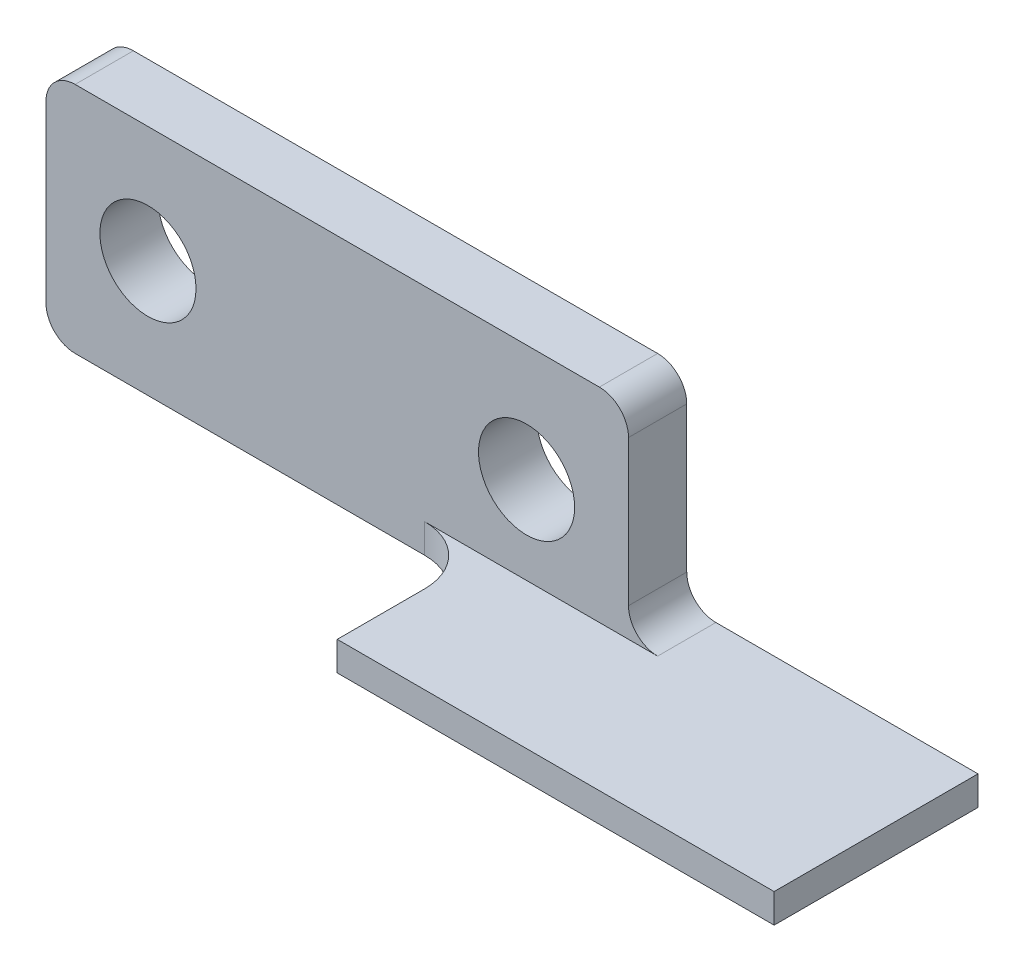
ISO-10303-21;
HEADER;
FILE_DESCRIPTION(('STEP AP214'),'2;1');
FILE_NAME('part.step','',(''),(''),'','','');
FILE_SCHEMA(('AUTOMOTIVE_DESIGN { 1 0 10303 214 1 1 1 1 }'));
ENDSEC;
DATA;
#1=APPLICATION_CONTEXT('core data for automotive mechanical design processes');
#2=APPLICATION_PROTOCOL_DEFINITION('international standard','automotive_design',2000,#1);
#3=PRODUCT_CONTEXT('',#1,'mechanical');
#4=PRODUCT('Part','Part','',(#3));
#5=PRODUCT_RELATED_PRODUCT_CATEGORY('part','',(#4));
#6=PRODUCT_DEFINITION_FORMATION('','',#4);
#7=PRODUCT_DEFINITION_CONTEXT('part definition',#1,'design');
#8=PRODUCT_DEFINITION('design','',#6,#7);
#9=PRODUCT_DEFINITION_SHAPE('','',#8);
#10=(LENGTH_UNIT() NAMED_UNIT(*) SI_UNIT(.MILLI.,.METRE.));
#11=(NAMED_UNIT(*) PLANE_ANGLE_UNIT() SI_UNIT($,.RADIAN.));
#12=(NAMED_UNIT(*) SI_UNIT($,.STERADIAN.) SOLID_ANGLE_UNIT());
#13=UNCERTAINTY_MEASURE_WITH_UNIT(LENGTH_MEASURE(1.E-05),#10,'distance_accuracy_value','');
#14=(GEOMETRIC_REPRESENTATION_CONTEXT(3) GLOBAL_UNCERTAINTY_ASSIGNED_CONTEXT((#13)) GLOBAL_UNIT_ASSIGNED_CONTEXT((#10,
#11,#12)) REPRESENTATION_CONTEXT('',''));
#15=CARTESIAN_POINT('',(0.,0.,0.));
#16=DIRECTION('',(0.,0.,1.));
#17=DIRECTION('',(1.,0.,0.));
#18=AXIS2_PLACEMENT_3D('',#15,#16,#17);
#19=CARTESIAN_POINT('',(0.,0.,2.));
#20=DIRECTION('',(1.,0.,0.));
#21=DIRECTION('',(0.,0.,-1.));
#22=AXIS2_PLACEMENT_3D('',#19,#20,#21);
#23=PLANE('',#22);
#24=DIRECTION('',(0.,-1.,0.));
#25=VECTOR('',#24,1.);
#26=CARTESIAN_POINT('',(0.,0.,2.));
#27=LINE('',#26,#25);
#28=CARTESIAN_POINT('',(0.,7.,2.));
#29=VERTEX_POINT('',#28);
#30=CARTESIAN_POINT('',(0.,1.,2.));
#31=VERTEX_POINT('',#30);
#32=EDGE_CURVE('E167',#29,#31,#27,.T.);
#33=ORIENTED_EDGE('',*,*,#32,.F.);
#34=DIRECTION('',(0.,0.,-1.));
#35=VECTOR('',#34,1.);
#36=CARTESIAN_POINT('',(0.,7.,2.));
#37=LINE('',#36,#35);
#38=CARTESIAN_POINT('',(0.,7.,0.));
#39=VERTEX_POINT('',#38);
#40=EDGE_CURVE('E216',#29,#39,#37,.T.);
#41=ORIENTED_EDGE('',*,*,#40,.T.);
#42=DIRECTION('',(0.,-1.,0.));
#43=VECTOR('',#42,1.);
#44=CARTESIAN_POINT('',(0.,0.,0.));
#45=LINE('',#44,#43);
#46=CARTESIAN_POINT('',(0.,1.,0.));
#47=VERTEX_POINT('',#46);
#48=EDGE_CURVE('E166',#39,#47,#45,.T.);
#49=ORIENTED_EDGE('',*,*,#48,.T.);
#50=DIRECTION('',(0.,0.,-1.));
#51=VECTOR('',#50,1.);
#52=CARTESIAN_POINT('',(0.,1.,2.));
#53=LINE('',#52,#51);
#54=EDGE_CURVE('E214',#47,#31,#53,.F.);
#55=ORIENTED_EDGE('',*,*,#54,.T.);
#56=EDGE_LOOP('',(#33,#41,#49,#55));
#57=FACE_BOUND('',#56,.T.);
#58=ADVANCED_FACE('F30',(#57),#23,.F.);
#59=CARTESIAN_POINT('',(0.,0.,2.));
#60=DIRECTION('',(0.,1.,0.));
#61=DIRECTION('',(0.,0.,1.));
#62=AXIS2_PLACEMENT_3D('',#59,#60,#61);
#63=PLANE('',#62);
#64=DIRECTION('',(1.,0.,0.));
#65=VECTOR('',#64,1.);
#66=CARTESIAN_POINT('',(0.,0.,2.));
#67=LINE('',#66,#65);
#68=CARTESIAN_POINT('',(1.,0.,2.));
#69=VERTEX_POINT('',#68);
#70=CARTESIAN_POINT('',(13.,0.,2.));
#71=VERTEX_POINT('',#70);
#72=EDGE_CURVE('E170',#69,#71,#67,.T.);
#73=ORIENTED_EDGE('',*,*,#72,.F.);
#74=DIRECTION('',(0.,0.,-1.));
#75=VECTOR('',#74,1.);
#76=CARTESIAN_POINT('',(1.,0.,2.));
#77=LINE('',#76,#75);
#78=CARTESIAN_POINT('',(1.,0.,0.));
#79=VERTEX_POINT('',#78);
#80=EDGE_CURVE('E219',#69,#79,#77,.T.);
#81=ORIENTED_EDGE('',*,*,#80,.T.);
#82=DIRECTION('',(1.,0.,0.));
#83=VECTOR('',#82,1.);
#84=CARTESIAN_POINT('',(0.,0.,0.));
#85=LINE('',#84,#83);
#86=CARTESIAN_POINT('',(30.,0.,0.));
#87=VERTEX_POINT('',#86);
#88=EDGE_CURVE('E183',#79,#87,#85,.T.);
#89=ORIENTED_EDGE('',*,*,#88,.T.);
#90=DIRECTION('',(0.,0.,1.));
#91=VECTOR('',#90,1.);
#92=CARTESIAN_POINT('',(30.,0.,0.));
#93=LINE('',#92,#91);
#94=CARTESIAN_POINT('',(30.,0.,7.));
#95=VERTEX_POINT('',#94);
#96=EDGE_CURVE('E128',#87,#95,#93,.T.);
#97=ORIENTED_EDGE('',*,*,#96,.T.);
#98=DIRECTION('',(1.,0.,0.));
#99=VECTOR('',#98,1.);
#100=CARTESIAN_POINT('',(15.,0.,7.));
#101=LINE('',#100,#99);
#102=CARTESIAN_POINT('',(15.,0.,7.));
#103=VERTEX_POINT('',#102);
#104=EDGE_CURVE('E132',#103,#95,#101,.T.);
#105=ORIENTED_EDGE('',*,*,#104,.F.);
#106=DIRECTION('',(0.,0.,1.));
#107=VECTOR('',#106,1.);
#108=CARTESIAN_POINT('',(15.,0.,0.));
#109=LINE('',#108,#107);
#110=CARTESIAN_POINT('',(15.,0.,4.));
#111=VERTEX_POINT('',#110);
#112=EDGE_CURVE('E121',#111,#103,#109,.T.);
#113=ORIENTED_EDGE('',*,*,#112,.F.);
#114=CARTESIAN_POINT('',(13.,0.,4.));
#115=DIRECTION('',(0.,1.,0.));
#116=DIRECTION('',(0.,0.,1.));
#117=AXIS2_PLACEMENT_3D('',#114,#115,#116);
#118=CIRCLE('',#117,2.);
#119=EDGE_CURVE('E11',#111,#71,#118,.T.);
#120=ORIENTED_EDGE('',*,*,#119,.T.);
#121=EDGE_LOOP('',(#73,#81,#89,#97,#105,#113,#120));
#122=FACE_BOUND('',#121,.T.);
#123=ADVANCED_FACE('F134',(#122),#63,.F.);
#124=CARTESIAN_POINT('',(20.,0.,2.));
#125=DIRECTION('',(-1.,0.,0.));
#126=DIRECTION('',(0.,0.,1.));
#127=AXIS2_PLACEMENT_3D('',#124,#125,#126);
#128=PLANE('',#127);
#129=DIRECTION('',(0.,1.,0.));
#130=VECTOR('',#129,1.);
#131=CARTESIAN_POINT('',(20.,0.,2.));
#132=LINE('',#131,#130);
#133=CARTESIAN_POINT('',(20.,2.,2.));
#134=VERTEX_POINT('',#133);
#135=CARTESIAN_POINT('',(20.,7.,2.));
#136=VERTEX_POINT('',#135);
#137=EDGE_CURVE('E174',#134,#136,#132,.T.);
#138=ORIENTED_EDGE('',*,*,#137,.F.);
#139=DIRECTION('',(0.,0.,-1.));
#140=VECTOR('',#139,1.);
#141=CARTESIAN_POINT('',(20.,2.,2.));
#142=LINE('',#141,#140);
#143=CARTESIAN_POINT('',(20.,2.,0.));
#144=VERTEX_POINT('',#143);
#145=EDGE_CURVE('E191',#134,#144,#142,.T.);
#146=ORIENTED_EDGE('',*,*,#145,.T.);
#147=DIRECTION('',(0.,1.,0.));
#148=VECTOR('',#147,1.);
#149=CARTESIAN_POINT('',(20.,0.,0.));
#150=LINE('',#149,#148);
#151=CARTESIAN_POINT('',(20.,7.,0.));
#152=VERTEX_POINT('',#151);
#153=EDGE_CURVE('E185',#144,#152,#150,.T.);
#154=ORIENTED_EDGE('',*,*,#153,.T.);
#155=DIRECTION('',(0.,0.,-1.));
#156=VECTOR('',#155,1.);
#157=CARTESIAN_POINT('',(20.,7.,2.));
#158=LINE('',#157,#156);
#159=EDGE_CURVE('E180',#152,#136,#158,.F.);
#160=ORIENTED_EDGE('',*,*,#159,.T.);
#161=EDGE_LOOP('',(#138,#146,#154,#160));
#162=FACE_BOUND('',#161,.T.);
#163=ADVANCED_FACE('F262',(#162),#128,.F.);
#164=CARTESIAN_POINT('',(0.,8.,2.));
#165=DIRECTION('',(0.,-1.,0.));
#166=DIRECTION('',(0.,0.,-1.));
#167=AXIS2_PLACEMENT_3D('',#164,#165,#166);
#168=PLANE('',#167);
#169=DIRECTION('',(-1.,0.,0.));
#170=VECTOR('',#169,1.);
#171=CARTESIAN_POINT('',(0.,8.,2.));
#172=LINE('',#171,#170);
#173=CARTESIAN_POINT('',(19.,8.,2.));
#174=VERTEX_POINT('',#173);
#175=CARTESIAN_POINT('',(1.,8.,2.));
#176=VERTEX_POINT('',#175);
#177=EDGE_CURVE('E177',#174,#176,#172,.T.);
#178=ORIENTED_EDGE('',*,*,#177,.F.);
#179=DIRECTION('',(0.,0.,-1.));
#180=VECTOR('',#179,1.);
#181=CARTESIAN_POINT('',(19.,8.,2.));
#182=LINE('',#181,#180);
#183=CARTESIAN_POINT('',(19.,8.,0.));
#184=VERTEX_POINT('',#183);
#185=EDGE_CURVE('E199',#174,#184,#182,.T.);
#186=ORIENTED_EDGE('',*,*,#185,.T.);
#187=DIRECTION('',(-1.,0.,0.));
#188=VECTOR('',#187,1.);
#189=CARTESIAN_POINT('',(0.,8.,0.));
#190=LINE('',#189,#188);
#191=CARTESIAN_POINT('',(1.,8.,0.));
#192=VERTEX_POINT('',#191);
#193=EDGE_CURVE('E171',#184,#192,#190,.T.);
#194=ORIENTED_EDGE('',*,*,#193,.T.);
#195=DIRECTION('',(0.,0.,-1.));
#196=VECTOR('',#195,1.);
#197=CARTESIAN_POINT('',(1.,8.,2.));
#198=LINE('',#197,#196);
#199=EDGE_CURVE('E197',#192,#176,#198,.F.);
#200=ORIENTED_EDGE('',*,*,#199,.T.);
#201=EDGE_LOOP('',(#178,#186,#194,#200));
#202=FACE_BOUND('',#201,.T.);
#203=ADVANCED_FACE('F253',(#202),#168,.F.);
#204=CARTESIAN_POINT('',(0.,8.,2.));
#205=DIRECTION('',(0.,0.,-1.));
#206=DIRECTION('',(-1.,0.,0.));
#207=AXIS2_PLACEMENT_3D('',#204,#205,#206);
#208=PLANE('',#207);
#209=CARTESIAN_POINT('',(16.5,4.,2.));
#210=DIRECTION('',(0.,0.,1.));
#211=DIRECTION('',(1.,0.,0.));
#212=AXIS2_PLACEMENT_3D('',#209,#210,#211);
#213=CIRCLE('',#212,1.65);
#214=CARTESIAN_POINT('',(18.15,4.,2.));
#215=VERTEX_POINT('',#214);
#216=EDGE_CURVE('E421',#215,#215,#213,.T.);
#217=ORIENTED_EDGE('',*,*,#216,.F.);
#218=EDGE_LOOP('',(#217));
#219=FACE_BOUND('',#218,.T.);
#220=CARTESIAN_POINT('',(3.5,4.,2.));
#221=DIRECTION('',(0.,0.,1.));
#222=DIRECTION('',(1.,0.,0.));
#223=AXIS2_PLACEMENT_3D('',#220,#221,#222);
#224=CIRCLE('',#223,1.65);
#225=CARTESIAN_POINT('',(5.15,4.,2.));
#226=VERTEX_POINT('',#225);
#227=EDGE_CURVE('E148',#226,#226,#224,.T.);
#228=ORIENTED_EDGE('',*,*,#227,.F.);
#229=EDGE_LOOP('',(#228));
#230=FACE_BOUND('',#229,.T.);
#231=ORIENTED_EDGE('',*,*,#72,.T.);
#232=DIRECTION('',(0.,1.,0.));
#233=VECTOR('',#232,1.);
#234=CARTESIAN_POINT('',(13.,8.,2.));
#235=LINE('',#234,#233);
#236=CARTESIAN_POINT('',(13.,1.,2.));
#237=VERTEX_POINT('',#236);
#238=EDGE_CURVE('E226',#71,#237,#235,.T.);
#239=ORIENTED_EDGE('',*,*,#238,.T.);
#240=DIRECTION('',(1.,0.,0.));
#241=VECTOR('',#240,1.);
#242=CARTESIAN_POINT('',(0.,1.,2.));
#243=LINE('',#242,#241);
#244=CARTESIAN_POINT('',(21.,1.,2.));
#245=VERTEX_POINT('',#244);
#246=EDGE_CURVE('E161',#237,#245,#243,.T.);
#247=ORIENTED_EDGE('',*,*,#246,.T.);
#248=CARTESIAN_POINT('',(21.,2.,2.));
#249=DIRECTION('',(0.,0.,-1.));
#250=DIRECTION('',(-1.,0.,0.));
#251=AXIS2_PLACEMENT_3D('',#248,#249,#250);
#252=CIRCLE('',#251,1.);
#253=EDGE_CURVE('E224',#245,#134,#252,.T.);
#254=ORIENTED_EDGE('',*,*,#253,.T.);
#255=ORIENTED_EDGE('',*,*,#137,.T.);
#256=CARTESIAN_POINT('',(19.,7.,2.));
#257=DIRECTION('',(0.,0.,-1.));
#258=DIRECTION('',(-1.,0.,0.));
#259=AXIS2_PLACEMENT_3D('',#256,#257,#258);
#260=CIRCLE('',#259,1.);
#261=EDGE_CURVE('E212',#136,#174,#260,.F.);
#262=ORIENTED_EDGE('',*,*,#261,.T.);
#263=ORIENTED_EDGE('',*,*,#177,.T.);
#264=CARTESIAN_POINT('',(1.,7.,2.));
#265=DIRECTION('',(0.,0.,-1.));
#266=DIRECTION('',(-1.,0.,0.));
#267=AXIS2_PLACEMENT_3D('',#264,#265,#266);
#268=CIRCLE('',#267,1.);
#269=EDGE_CURVE('E210',#176,#29,#268,.F.);
#270=ORIENTED_EDGE('',*,*,#269,.T.);
#271=ORIENTED_EDGE('',*,*,#32,.T.);
#272=CARTESIAN_POINT('',(1.,1.,2.));
#273=DIRECTION('',(0.,0.,-1.));
#274=DIRECTION('',(-1.,0.,0.));
#275=AXIS2_PLACEMENT_3D('',#272,#273,#274);
#276=CIRCLE('',#275,1.);
#277=EDGE_CURVE('E208',#31,#69,#276,.F.);
#278=ORIENTED_EDGE('',*,*,#277,.T.);
#279=EDGE_LOOP('',(#231,#239,#247,#254,#255,#262,#263,#270,#271,#278));
#280=FACE_BOUND('',#279,.T.);
#281=ADVANCED_FACE('F231',(#219,#230,#280),#208,.F.);
#282=CARTESIAN_POINT('',(0.,8.,0.));
#283=DIRECTION('',(0.,0.,-1.));
#284=DIRECTION('',(-1.,0.,0.));
#285=AXIS2_PLACEMENT_3D('',#282,#283,#284);
#286=PLANE('',#285);
#287=CARTESIAN_POINT('',(16.5,4.,0.));
#288=DIRECTION('',(0.,0.,1.));
#289=DIRECTION('',(1.,0.,0.));
#290=AXIS2_PLACEMENT_3D('',#287,#288,#289);
#291=CIRCLE('',#290,1.65);
#292=CARTESIAN_POINT('',(18.15,4.,0.));
#293=VERTEX_POINT('',#292);
#294=EDGE_CURVE('E419',#293,#293,#291,.T.);
#295=ORIENTED_EDGE('',*,*,#294,.T.);
#296=EDGE_LOOP('',(#295));
#297=FACE_BOUND('',#296,.T.);
#298=CARTESIAN_POINT('',(3.5,4.,0.));
#299=DIRECTION('',(0.,0.,1.));
#300=DIRECTION('',(1.,0.,0.));
#301=AXIS2_PLACEMENT_3D('',#298,#299,#300);
#302=CIRCLE('',#301,1.65);
#303=CARTESIAN_POINT('',(5.15,4.,0.));
#304=VERTEX_POINT('',#303);
#305=EDGE_CURVE('E145',#304,#304,#302,.T.);
#306=ORIENTED_EDGE('',*,*,#305,.T.);
#307=EDGE_LOOP('',(#306));
#308=FACE_BOUND('',#307,.T.);
#309=ORIENTED_EDGE('',*,*,#193,.F.);
#310=CARTESIAN_POINT('',(19.,7.,0.));
#311=DIRECTION('',(0.,0.,-1.));
#312=DIRECTION('',(-1.,0.,0.));
#313=AXIS2_PLACEMENT_3D('',#310,#311,#312);
#314=CIRCLE('',#313,1.);
#315=EDGE_CURVE('E206',#184,#152,#314,.T.);
#316=ORIENTED_EDGE('',*,*,#315,.T.);
#317=ORIENTED_EDGE('',*,*,#153,.F.);
#318=CARTESIAN_POINT('',(21.,2.,0.));
#319=DIRECTION('',(0.,0.,-1.));
#320=DIRECTION('',(-1.,0.,0.));
#321=AXIS2_PLACEMENT_3D('',#318,#319,#320);
#322=CIRCLE('',#321,1.);
#323=CARTESIAN_POINT('',(21.,1.,0.));
#324=VERTEX_POINT('',#323);
#325=EDGE_CURVE('E222',#144,#324,#322,.F.);
#326=ORIENTED_EDGE('',*,*,#325,.T.);
#327=DIRECTION('',(-1.,0.,0.));
#328=VECTOR('',#327,1.);
#329=CARTESIAN_POINT('',(15.,1.,0.));
#330=LINE('',#329,#328);
#331=CARTESIAN_POINT('',(30.,1.,0.));
#332=VERTEX_POINT('',#331);
#333=EDGE_CURVE('E129',#332,#324,#330,.T.);
#334=ORIENTED_EDGE('',*,*,#333,.F.);
#335=DIRECTION('',(0.,1.,0.));
#336=VECTOR('',#335,1.);
#337=CARTESIAN_POINT('',(30.,0.,0.));
#338=LINE('',#337,#336);
#339=EDGE_CURVE('E154',#87,#332,#338,.T.);
#340=ORIENTED_EDGE('',*,*,#339,.F.);
#341=ORIENTED_EDGE('',*,*,#88,.F.);
#342=CARTESIAN_POINT('',(1.,1.,0.));
#343=DIRECTION('',(0.,0.,-1.));
#344=DIRECTION('',(-1.,0.,0.));
#345=AXIS2_PLACEMENT_3D('',#342,#343,#344);
#346=CIRCLE('',#345,1.);
#347=EDGE_CURVE('E202',#79,#47,#346,.T.);
#348=ORIENTED_EDGE('',*,*,#347,.T.);
#349=ORIENTED_EDGE('',*,*,#48,.F.);
#350=CARTESIAN_POINT('',(1.,7.,0.));
#351=DIRECTION('',(0.,0.,-1.));
#352=DIRECTION('',(-1.,0.,0.));
#353=AXIS2_PLACEMENT_3D('',#350,#351,#352);
#354=CIRCLE('',#353,1.);
#355=EDGE_CURVE('E204',#39,#192,#354,.T.);
#356=ORIENTED_EDGE('',*,*,#355,.T.);
#357=EDGE_LOOP('',(#309,#316,#317,#326,#334,#340,#341,#348,#349,#356));
#358=FACE_BOUND('',#357,.T.);
#359=ADVANCED_FACE('F242',(#297,#308,#358),#286,.T.);
#360=CARTESIAN_POINT('',(15.,0.,0.));
#361=DIRECTION('',(-1.,0.,0.));
#362=DIRECTION('',(0.,0.,1.));
#363=AXIS2_PLACEMENT_3D('',#360,#361,#362);
#364=PLANE('',#363);
#365=DIRECTION('',(0.,0.,1.));
#366=VECTOR('',#365,1.);
#367=CARTESIAN_POINT('',(15.,1.,0.));
#368=LINE('',#367,#366);
#369=CARTESIAN_POINT('',(15.,1.,4.));
#370=VERTEX_POINT('',#369);
#371=CARTESIAN_POINT('',(15.,1.,7.));
#372=VERTEX_POINT('',#371);
#373=EDGE_CURVE('E159',#370,#372,#368,.T.);
#374=ORIENTED_EDGE('',*,*,#373,.F.);
#375=DIRECTION('',(0.,1.,0.));
#376=VECTOR('',#375,1.);
#377=CARTESIAN_POINT('',(15.,0.,4.));
#378=LINE('',#377,#376);
#379=EDGE_CURVE('E51',#370,#111,#378,.F.);
#380=ORIENTED_EDGE('',*,*,#379,.T.);
#381=ORIENTED_EDGE('',*,*,#112,.T.);
#382=DIRECTION('',(0.,-1.,0.));
#383=VECTOR('',#382,1.);
#384=CARTESIAN_POINT('',(15.,0.,7.));
#385=LINE('',#384,#383);
#386=EDGE_CURVE('E125',#372,#103,#385,.T.);
#387=ORIENTED_EDGE('',*,*,#386,.F.);
#388=EDGE_LOOP('',(#374,#380,#381,#387));
#389=FACE_BOUND('',#388,.T.);
#390=ADVANCED_FACE('F123',(#389),#364,.T.);
#391=CARTESIAN_POINT('',(15.,1.,0.));
#392=DIRECTION('',(0.,1.,0.));
#393=DIRECTION('',(0.,0.,1.));
#394=AXIS2_PLACEMENT_3D('',#391,#392,#393);
#395=PLANE('',#394);
#396=ORIENTED_EDGE('',*,*,#333,.T.);
#397=DIRECTION('',(0.,0.,-1.));
#398=VECTOR('',#397,1.);
#399=CARTESIAN_POINT('',(21.,1.,0.));
#400=LINE('',#399,#398);
#401=EDGE_CURVE('E194',#324,#245,#400,.F.);
#402=ORIENTED_EDGE('',*,*,#401,.T.);
#403=ORIENTED_EDGE('',*,*,#246,.F.);
#404=CARTESIAN_POINT('',(13.,1.,4.));
#405=DIRECTION('',(0.,1.,0.));
#406=DIRECTION('',(0.,0.,1.));
#407=AXIS2_PLACEMENT_3D('',#404,#405,#406);
#408=CIRCLE('',#407,2.);
#409=EDGE_CURVE('E38',#237,#370,#408,.F.);
#410=ORIENTED_EDGE('',*,*,#409,.T.);
#411=ORIENTED_EDGE('',*,*,#373,.T.);
#412=DIRECTION('',(-1.,0.,0.));
#413=VECTOR('',#412,1.);
#414=CARTESIAN_POINT('',(15.,1.,7.));
#415=LINE('',#414,#413);
#416=CARTESIAN_POINT('',(30.,1.,7.));
#417=VERTEX_POINT('',#416);
#418=EDGE_CURVE('E144',#417,#372,#415,.T.);
#419=ORIENTED_EDGE('',*,*,#418,.F.);
#420=DIRECTION('',(0.,0.,1.));
#421=VECTOR('',#420,1.);
#422=CARTESIAN_POINT('',(30.,1.,0.));
#423=LINE('',#422,#421);
#424=EDGE_CURVE('E162',#332,#417,#423,.T.);
#425=ORIENTED_EDGE('',*,*,#424,.F.);
#426=EDGE_LOOP('',(#396,#402,#403,#410,#411,#419,#425));
#427=FACE_BOUND('',#426,.T.);
#428=ADVANCED_FACE('F269',(#427),#395,.T.);
#429=CARTESIAN_POINT('',(30.,0.,0.));
#430=DIRECTION('',(1.,0.,0.));
#431=DIRECTION('',(0.,0.,-1.));
#432=AXIS2_PLACEMENT_3D('',#429,#430,#431);
#433=PLANE('',#432);
#434=ORIENTED_EDGE('',*,*,#424,.T.);
#435=DIRECTION('',(0.,1.,0.));
#436=VECTOR('',#435,1.);
#437=CARTESIAN_POINT('',(30.,0.,7.));
#438=LINE('',#437,#436);
#439=EDGE_CURVE('E139',#95,#417,#438,.T.);
#440=ORIENTED_EDGE('',*,*,#439,.F.);
#441=ORIENTED_EDGE('',*,*,#96,.F.);
#442=ORIENTED_EDGE('',*,*,#339,.T.);
#443=EDGE_LOOP('',(#434,#440,#441,#442));
#444=FACE_BOUND('',#443,.T.);
#445=ADVANCED_FACE('F271',(#444),#433,.T.);
#446=CARTESIAN_POINT('',(15.,1.,7.));
#447=DIRECTION('',(0.,0.,-1.));
#448=DIRECTION('',(-1.,0.,0.));
#449=AXIS2_PLACEMENT_3D('',#446,#447,#448);
#450=PLANE('',#449);
#451=ORIENTED_EDGE('',*,*,#386,.T.);
#452=ORIENTED_EDGE('',*,*,#104,.T.);
#453=ORIENTED_EDGE('',*,*,#439,.T.);
#454=ORIENTED_EDGE('',*,*,#418,.T.);
#455=EDGE_LOOP('',(#451,#452,#453,#454));
#456=FACE_BOUND('',#455,.T.);
#457=ADVANCED_FACE('F142',(#456),#450,.F.);
#458=CARTESIAN_POINT('',(3.5,4.,0.));
#459=DIRECTION('',(0.,0.,1.));
#460=DIRECTION('',(1.,0.,0.));
#461=AXIS2_PLACEMENT_3D('',#458,#459,#460);
#462=CYLINDRICAL_SURFACE('',#461,1.65);
#463=ORIENTED_EDGE('',*,*,#305,.F.);
#464=EDGE_LOOP('',(#463));
#465=FACE_BOUND('',#464,.T.);
#466=ORIENTED_EDGE('',*,*,#227,.T.);
#467=EDGE_LOOP('',(#466));
#468=FACE_BOUND('',#467,.T.);
#469=ADVANCED_FACE('F278',(#465,#468),#462,.F.);
#470=CARTESIAN_POINT('',(16.5,4.,0.));
#471=DIRECTION('',(0.,0.,1.));
#472=DIRECTION('',(1.,0.,0.));
#473=AXIS2_PLACEMENT_3D('',#470,#471,#472);
#474=CYLINDRICAL_SURFACE('',#473,1.65);
#475=ORIENTED_EDGE('',*,*,#294,.F.);
#476=EDGE_LOOP('',(#475));
#477=FACE_BOUND('',#476,.T.);
#478=ORIENTED_EDGE('',*,*,#216,.T.);
#479=EDGE_LOOP('',(#478));
#480=FACE_BOUND('',#479,.T.);
#481=ADVANCED_FACE('F292',(#477,#480),#474,.F.);
#482=CARTESIAN_POINT('',(21.,2.,2.));
#483=DIRECTION('',(0.,0.,-1.));
#484=DIRECTION('',(-1.,0.,0.));
#485=AXIS2_PLACEMENT_3D('',#482,#483,#484);
#486=CYLINDRICAL_SURFACE('',#485,1.);
#487=ORIENTED_EDGE('',*,*,#253,.F.);
#488=ORIENTED_EDGE('',*,*,#401,.F.);
#489=ORIENTED_EDGE('',*,*,#325,.F.);
#490=ORIENTED_EDGE('',*,*,#145,.F.);
#491=EDGE_LOOP('',(#487,#488,#489,#490));
#492=FACE_BOUND('',#491,.T.);
#493=ADVANCED_FACE('F266',(#492),#486,.F.);
#494=CARTESIAN_POINT('',(19.,7.,2.));
#495=DIRECTION('',(0.,0.,-1.));
#496=DIRECTION('',(-1.,0.,0.));
#497=AXIS2_PLACEMENT_3D('',#494,#495,#496);
#498=CYLINDRICAL_SURFACE('',#497,1.);
#499=ORIENTED_EDGE('',*,*,#261,.F.);
#500=ORIENTED_EDGE('',*,*,#159,.F.);
#501=ORIENTED_EDGE('',*,*,#315,.F.);
#502=ORIENTED_EDGE('',*,*,#185,.F.);
#503=EDGE_LOOP('',(#499,#500,#501,#502));
#504=FACE_BOUND('',#503,.T.);
#505=ADVANCED_FACE('F257',(#504),#498,.T.);
#506=CARTESIAN_POINT('',(1.,7.,2.));
#507=DIRECTION('',(0.,0.,-1.));
#508=DIRECTION('',(-1.,0.,0.));
#509=AXIS2_PLACEMENT_3D('',#506,#507,#508);
#510=CYLINDRICAL_SURFACE('',#509,1.);
#511=ORIENTED_EDGE('',*,*,#269,.F.);
#512=ORIENTED_EDGE('',*,*,#199,.F.);
#513=ORIENTED_EDGE('',*,*,#355,.F.);
#514=ORIENTED_EDGE('',*,*,#40,.F.);
#515=EDGE_LOOP('',(#511,#512,#513,#514));
#516=FACE_BOUND('',#515,.T.);
#517=ADVANCED_FACE('F249',(#516),#510,.T.);
#518=CARTESIAN_POINT('',(1.,1.,2.));
#519=DIRECTION('',(0.,0.,-1.));
#520=DIRECTION('',(-1.,0.,0.));
#521=AXIS2_PLACEMENT_3D('',#518,#519,#520);
#522=CYLINDRICAL_SURFACE('',#521,1.);
#523=ORIENTED_EDGE('',*,*,#277,.F.);
#524=ORIENTED_EDGE('',*,*,#54,.F.);
#525=ORIENTED_EDGE('',*,*,#347,.F.);
#526=ORIENTED_EDGE('',*,*,#80,.F.);
#527=EDGE_LOOP('',(#523,#524,#525,#526));
#528=FACE_BOUND('',#527,.T.);
#529=ADVANCED_FACE('F237',(#528),#522,.T.);
#530=CARTESIAN_POINT('',(13.,8.,4.));
#531=DIRECTION('',(0.,1.,0.));
#532=DIRECTION('',(0.,0.,1.));
#533=AXIS2_PLACEMENT_3D('',#530,#531,#532);
#534=CYLINDRICAL_SURFACE('',#533,2.);
#535=ORIENTED_EDGE('',*,*,#119,.F.);
#536=ORIENTED_EDGE('',*,*,#379,.F.);
#537=ORIENTED_EDGE('',*,*,#409,.F.);
#538=ORIENTED_EDGE('',*,*,#238,.F.);
#539=EDGE_LOOP('',(#535,#536,#537,#538));
#540=FACE_BOUND('',#539,.T.);
#541=ADVANCED_FACE('F32',(#540),#534,.F.);
#542=CLOSED_SHELL('',(#58,#123,#163,#203,#281,#359,#390,#428,#445,#457,#469,#481,#493,#505,#517,
#529,#541));
#543=MANIFOLD_SOLID_BREP('B2',#542);
#544=ADVANCED_BREP_SHAPE_REPRESENTATION('',(#18,#543),#14);
#545=SHAPE_DEFINITION_REPRESENTATION(#9,#544);
ENDSEC;
END-ISO-10303-21;
